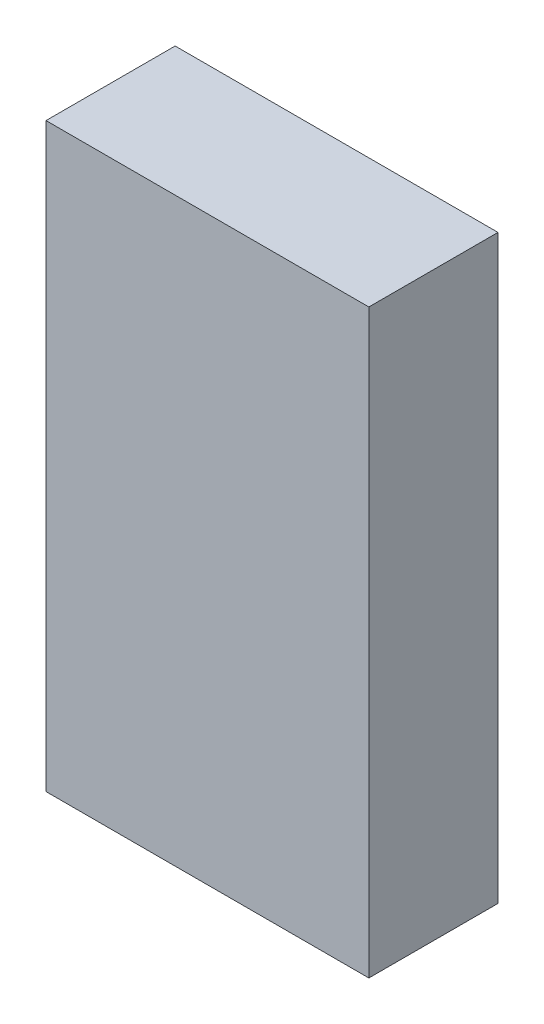
ISO-10303-21;
HEADER;
FILE_DESCRIPTION(('STEP AP214'),'2;1');
FILE_NAME('part.step','',(''),(''),'','','');
FILE_SCHEMA(('AUTOMOTIVE_DESIGN { 1 0 10303 214 1 1 1 1 }'));
ENDSEC;
DATA;
#1=APPLICATION_CONTEXT('core data for automotive mechanical design processes');
#2=APPLICATION_PROTOCOL_DEFINITION('international standard','automotive_design',2000,#1);
#3=PRODUCT_CONTEXT('',#1,'mechanical');
#4=PRODUCT('Part','Part','',(#3));
#5=PRODUCT_RELATED_PRODUCT_CATEGORY('part','',(#4));
#6=PRODUCT_DEFINITION_FORMATION('','',#4);
#7=PRODUCT_DEFINITION_CONTEXT('part definition',#1,'design');
#8=PRODUCT_DEFINITION('design','',#6,#7);
#9=PRODUCT_DEFINITION_SHAPE('','',#8);
#10=(LENGTH_UNIT() NAMED_UNIT(*) SI_UNIT(.MILLI.,.METRE.));
#11=(NAMED_UNIT(*) PLANE_ANGLE_UNIT() SI_UNIT($,.RADIAN.));
#12=(NAMED_UNIT(*) SI_UNIT($,.STERADIAN.) SOLID_ANGLE_UNIT());
#13=UNCERTAINTY_MEASURE_WITH_UNIT(LENGTH_MEASURE(1.E-05),#10,'distance_accuracy_value','');
#14=(GEOMETRIC_REPRESENTATION_CONTEXT(3) GLOBAL_UNCERTAINTY_ASSIGNED_CONTEXT((#13)) GLOBAL_UNIT_ASSIGNED_CONTEXT((#10,
#11,#12)) REPRESENTATION_CONTEXT('',''));
#15=CARTESIAN_POINT('',(0.,0.,0.));
#16=DIRECTION('',(0.,0.,1.));
#17=DIRECTION('',(1.,0.,0.));
#18=AXIS2_PLACEMENT_3D('',#15,#16,#17);
#19=CARTESIAN_POINT('',(0.875,1.6,0.));
#20=DIRECTION('',(1.,0.,0.));
#21=DIRECTION('',(0.,0.,1.));
#22=AXIS2_PLACEMENT_3D('',#19,#20,#21);
#23=PLANE('',#22);
#24=DIRECTION('',(0.,1.,0.));
#25=VECTOR('',#24,1.);
#26=CARTESIAN_POINT('',(0.875,1.6,0.1));
#27=LINE('',#26,#25);
#28=CARTESIAN_POINT('',(0.875,1.6,0.1));
#29=VERTEX_POINT('',#28);
#30=CARTESIAN_POINT('',(0.875,2.05,0.1));
#31=VERTEX_POINT('',#30);
#32=EDGE_CURVE('E11',#29,#31,#27,.T.);
#33=ORIENTED_EDGE('',*,*,#32,.T.);
#34=DIRECTION('',(0.,0.,1.));
#35=VECTOR('',#34,1.);
#36=CARTESIAN_POINT('',(0.875,2.05,0.));
#37=LINE('',#36,#35);
#38=CARTESIAN_POINT('',(0.875,2.05,0.));
#39=VERTEX_POINT('',#38);
#40=EDGE_CURVE('E24',#39,#31,#37,.T.);
#41=ORIENTED_EDGE('',*,*,#40,.F.);
#42=DIRECTION('',(0.,1.,0.));
#43=VECTOR('',#42,1.);
#44=CARTESIAN_POINT('',(0.875,1.6,0.));
#45=LINE('',#44,#43);
#46=CARTESIAN_POINT('',(0.875,1.6,0.));
#47=VERTEX_POINT('',#46);
#48=EDGE_CURVE('E86',#47,#39,#45,.T.);
#49=ORIENTED_EDGE('',*,*,#48,.F.);
#50=DIRECTION('',(0.,0.,1.));
#51=VECTOR('',#50,1.);
#52=CARTESIAN_POINT('',(0.875,1.6,0.));
#53=LINE('',#52,#51);
#54=EDGE_CURVE('E36',#47,#29,#53,.T.);
#55=ORIENTED_EDGE('',*,*,#54,.T.);
#56=EDGE_LOOP('',(#33,#41,#49,#55));
#57=FACE_BOUND('',#56,.T.);
#58=ADVANCED_FACE('F17',(#57),#23,.F.);
#59=CARTESIAN_POINT('',(1.125,1.6,0.));
#60=DIRECTION('',(1.,0.,0.));
#61=DIRECTION('',(0.,0.,1.));
#62=AXIS2_PLACEMENT_3D('',#59,#60,#61);
#63=PLANE('',#62);
#64=DIRECTION('',(0.,0.,1.));
#65=VECTOR('',#64,1.);
#66=CARTESIAN_POINT('',(1.125,1.6,0.));
#67=LINE('',#66,#65);
#68=CARTESIAN_POINT('',(1.125,1.6,0.));
#69=VERTEX_POINT('',#68);
#70=CARTESIAN_POINT('',(1.125,1.6,0.1));
#71=VERTEX_POINT('',#70);
#72=EDGE_CURVE('E83',#69,#71,#67,.T.);
#73=ORIENTED_EDGE('',*,*,#72,.F.);
#74=DIRECTION('',(0.,1.,0.));
#75=VECTOR('',#74,1.);
#76=CARTESIAN_POINT('',(1.125,1.6,0.));
#77=LINE('',#76,#75);
#78=CARTESIAN_POINT('',(1.125,2.05,0.));
#79=VERTEX_POINT('',#78);
#80=EDGE_CURVE('E63',#69,#79,#77,.T.);
#81=ORIENTED_EDGE('',*,*,#80,.T.);
#82=DIRECTION('',(0.,0.,1.));
#83=VECTOR('',#82,1.);
#84=CARTESIAN_POINT('',(1.125,2.05,0.));
#85=LINE('',#84,#83);
#86=CARTESIAN_POINT('',(1.125,2.05,0.1));
#87=VERTEX_POINT('',#86);
#88=EDGE_CURVE('E57',#79,#87,#85,.T.);
#89=ORIENTED_EDGE('',*,*,#88,.T.);
#90=DIRECTION('',(0.,1.,0.));
#91=VECTOR('',#90,1.);
#92=CARTESIAN_POINT('',(1.125,1.6,0.1));
#93=LINE('',#92,#91);
#94=EDGE_CURVE('E60',#71,#87,#93,.T.);
#95=ORIENTED_EDGE('',*,*,#94,.F.);
#96=EDGE_LOOP('',(#73,#81,#89,#95));
#97=FACE_BOUND('',#96,.T.);
#98=ADVANCED_FACE('F59',(#97),#63,.T.);
#99=CARTESIAN_POINT('',(0.875,1.6,0.));
#100=DIRECTION('',(0.,1.,0.));
#101=DIRECTION('',(0.,0.,1.));
#102=AXIS2_PLACEMENT_3D('',#99,#100,#101);
#103=PLANE('',#102);
#104=ORIENTED_EDGE('',*,*,#72,.T.);
#105=DIRECTION('',(1.,0.,0.));
#106=VECTOR('',#105,1.);
#107=CARTESIAN_POINT('',(0.875,1.6,0.1));
#108=LINE('',#107,#106);
#109=EDGE_CURVE('E71',#29,#71,#108,.T.);
#110=ORIENTED_EDGE('',*,*,#109,.F.);
#111=ORIENTED_EDGE('',*,*,#54,.F.);
#112=DIRECTION('',(1.,0.,0.));
#113=VECTOR('',#112,1.);
#114=CARTESIAN_POINT('',(0.875,1.6,0.));
#115=LINE('',#114,#113);
#116=EDGE_CURVE('E76',#47,#69,#115,.T.);
#117=ORIENTED_EDGE('',*,*,#116,.T.);
#118=EDGE_LOOP('',(#104,#110,#111,#117));
#119=FACE_BOUND('',#118,.T.);
#120=ADVANCED_FACE('F91',(#119),#103,.F.);
#121=CARTESIAN_POINT('',(0.875,2.05,0.));
#122=DIRECTION('',(0.,1.,0.));
#123=DIRECTION('',(0.,0.,1.));
#124=AXIS2_PLACEMENT_3D('',#121,#122,#123);
#125=PLANE('',#124);
#126=DIRECTION('',(1.,0.,0.));
#127=VECTOR('',#126,1.);
#128=CARTESIAN_POINT('',(0.875,2.05,0.));
#129=LINE('',#128,#127);
#130=EDGE_CURVE('E74',#39,#79,#129,.T.);
#131=ORIENTED_EDGE('',*,*,#130,.F.);
#132=ORIENTED_EDGE('',*,*,#40,.T.);
#133=DIRECTION('',(1.,0.,0.));
#134=VECTOR('',#133,1.);
#135=CARTESIAN_POINT('',(0.875,2.05,0.1));
#136=LINE('',#135,#134);
#137=EDGE_CURVE('E69',#31,#87,#136,.T.);
#138=ORIENTED_EDGE('',*,*,#137,.T.);
#139=ORIENTED_EDGE('',*,*,#88,.F.);
#140=EDGE_LOOP('',(#131,#132,#138,#139));
#141=FACE_BOUND('',#140,.T.);
#142=ADVANCED_FACE('F73',(#141),#125,.T.);
#143=CARTESIAN_POINT('',(0.875,1.6,0.));
#144=DIRECTION('',(0.,0.,1.));
#145=DIRECTION('',(1.,0.,0.));
#146=AXIS2_PLACEMENT_3D('',#143,#144,#145);
#147=PLANE('',#146);
#148=ORIENTED_EDGE('',*,*,#130,.T.);
#149=ORIENTED_EDGE('',*,*,#80,.F.);
#150=ORIENTED_EDGE('',*,*,#116,.F.);
#151=ORIENTED_EDGE('',*,*,#48,.T.);
#152=EDGE_LOOP('',(#148,#149,#150,#151));
#153=FACE_BOUND('',#152,.T.);
#154=ADVANCED_FACE('F89',(#153),#147,.F.);
#155=CARTESIAN_POINT('',(0.875,1.6,0.1));
#156=DIRECTION('',(0.,0.,1.));
#157=DIRECTION('',(1.,0.,0.));
#158=AXIS2_PLACEMENT_3D('',#155,#156,#157);
#159=PLANE('',#158);
#160=ORIENTED_EDGE('',*,*,#32,.F.);
#161=ORIENTED_EDGE('',*,*,#109,.T.);
#162=ORIENTED_EDGE('',*,*,#94,.T.);
#163=ORIENTED_EDGE('',*,*,#137,.F.);
#164=EDGE_LOOP('',(#160,#161,#162,#163));
#165=FACE_BOUND('',#164,.T.);
#166=ADVANCED_FACE('F68',(#165),#159,.T.);
#167=CLOSED_SHELL('',(#58,#98,#120,#142,#154,#166));
#168=MANIFOLD_SOLID_BREP('B1',#167);
#169=ADVANCED_BREP_SHAPE_REPRESENTATION('',(#18,#168),#14);
#170=SHAPE_DEFINITION_REPRESENTATION(#9,#169);
ENDSEC;
END-ISO-10303-21;
